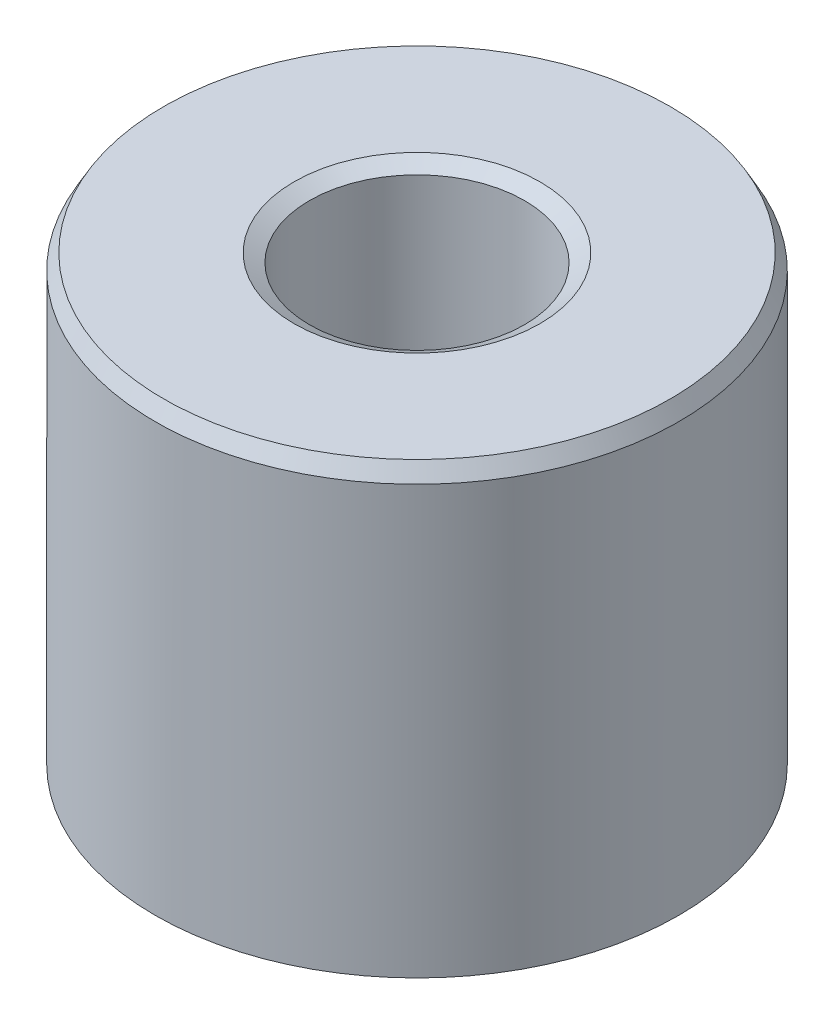
ISO-10303-21;
HEADER;
FILE_DESCRIPTION(('STEP AP214'),'2;1');
FILE_NAME('part.step','',(''),(''),'','','');
FILE_SCHEMA(('AUTOMOTIVE_DESIGN { 1 0 10303 214 1 1 1 1 }'));
ENDSEC;
DATA;
#1=APPLICATION_CONTEXT('core data for automotive mechanical design processes');
#2=APPLICATION_PROTOCOL_DEFINITION('international standard','automotive_design',2000,#1);
#3=PRODUCT_CONTEXT('',#1,'mechanical');
#4=PRODUCT('Part','Part','',(#3));
#5=PRODUCT_RELATED_PRODUCT_CATEGORY('part','',(#4));
#6=PRODUCT_DEFINITION_FORMATION('','',#4);
#7=PRODUCT_DEFINITION_CONTEXT('part definition',#1,'design');
#8=PRODUCT_DEFINITION('design','',#6,#7);
#9=PRODUCT_DEFINITION_SHAPE('','',#8);
#10=(LENGTH_UNIT() NAMED_UNIT(*) SI_UNIT(.MILLI.,.METRE.));
#11=(NAMED_UNIT(*) PLANE_ANGLE_UNIT() SI_UNIT($,.RADIAN.));
#12=(NAMED_UNIT(*) SI_UNIT($,.STERADIAN.) SOLID_ANGLE_UNIT());
#13=UNCERTAINTY_MEASURE_WITH_UNIT(LENGTH_MEASURE(1.E-05),#10,'distance_accuracy_value','');
#14=(GEOMETRIC_REPRESENTATION_CONTEXT(3) GLOBAL_UNCERTAINTY_ASSIGNED_CONTEXT((#13)) GLOBAL_UNIT_ASSIGNED_CONTEXT((#10,
#11,#12)) REPRESENTATION_CONTEXT('',''));
#15=CARTESIAN_POINT('',(0.,0.,0.));
#16=DIRECTION('',(0.,0.,1.));
#17=DIRECTION('',(1.,0.,0.));
#18=AXIS2_PLACEMENT_3D('',#15,#16,#17);
#19=CARTESIAN_POINT('',(0.,12.9313803341027,0.));
#20=DIRECTION('',(0.,-1.,0.));
#21=DIRECTION('',(0.,0.,-1.));
#22=AXIS2_PLACEMENT_3D('',#19,#20,#21);
#23=CYLINDRICAL_SURFACE('',#22,7.5);
#24=CARTESIAN_POINT('',(0.,0.245773306518281,0.));
#25=DIRECTION('',(0.,1.,0.));
#26=DIRECTION('',(0.,0.,1.));
#27=AXIS2_PLACEMENT_3D('',#24,#25,#26);
#28=CIRCLE('',#27,7.5);
#29=CARTESIAN_POINT('',(0.,0.245773306518279,-7.5));
#30=VERTEX_POINT('',#29);
#31=EDGE_CURVE('E10',#30,#30,#28,.T.);
#32=CARTESIAN_POINT('',(0.,12.4912057877324,0.));
#33=DIRECTION('',(0.,1.,0.));
#34=DIRECTION('',(0.,0.,1.));
#35=AXIS2_PLACEMENT_3D('',#32,#33,#34);
#36=CIRCLE('',#35,7.5);
#37=CARTESIAN_POINT('',(0.,12.4912057877324,-7.5));
#38=VERTEX_POINT('',#37);
#39=EDGE_CURVE('E50',#38,#38,#36,.F.);
#40=CARTESIAN_POINT('',(0.,0.245773306518279,-7.5));
#41=CARTESIAN_POINT('',(0.,0.373329894864259,-7.5));
#42=CARTESIAN_POINT('',(0.,0.50088648321024,-7.5));
#43=CARTESIAN_POINT('',(0.,0.755999659902201,-7.5));
#44=CARTESIAN_POINT('',(0.,0.883556248248181,-7.5));
#45=CARTESIAN_POINT('',(0.,1.13866942494014,-7.5));
#46=CARTESIAN_POINT('',(0.,1.26622601328612,-7.5));
#47=CARTESIAN_POINT('',(0.,1.52133918997808,-7.5));
#48=CARTESIAN_POINT('',(0.,1.64889577832406,-7.5));
#49=CARTESIAN_POINT('',(0.,1.90400895501603,-7.5));
#50=CARTESIAN_POINT('',(0.,2.03156554336201,-7.5));
#51=CARTESIAN_POINT('',(0.,2.28667872005397,-7.5));
#52=CARTESIAN_POINT('',(0.,2.41423530839995,-7.5));
#53=CARTESIAN_POINT('',(0.,2.66934848509191,-7.5));
#54=CARTESIAN_POINT('',(0.,2.79690507343789,-7.5));
#55=CARTESIAN_POINT('',(0.,3.05201825012985,-7.5));
#56=CARTESIAN_POINT('',(0.,3.17957483847583,-7.5));
#57=CARTESIAN_POINT('',(0.,3.43468801516779,-7.5));
#58=CARTESIAN_POINT('',(0.,3.56224460351377,-7.5));
#59=CARTESIAN_POINT('',(0.,3.81735778020573,-7.5));
#60=CARTESIAN_POINT('',(0.,3.94491436855171,-7.5));
#61=CARTESIAN_POINT('',(0.,4.20002754524368,-7.5));
#62=CARTESIAN_POINT('',(0.,4.32758413358966,-7.5));
#63=CARTESIAN_POINT('',(0.,4.58269731028162,-7.5));
#64=CARTESIAN_POINT('',(0.,4.7102538986276,-7.5));
#65=CARTESIAN_POINT('',(0.,4.96536707531956,-7.5));
#66=CARTESIAN_POINT('',(0.,5.09292366366554,-7.5));
#67=CARTESIAN_POINT('',(0.,5.3480368403575,-7.5));
#68=CARTESIAN_POINT('',(0.,5.47559342870348,-7.5));
#69=CARTESIAN_POINT('',(0.,5.73070660539544,-7.5));
#70=CARTESIAN_POINT('',(0.,5.85826319374142,-7.5));
#71=CARTESIAN_POINT('',(0.,6.11337637043338,-7.5));
#72=CARTESIAN_POINT('',(0.,6.24093295877936,-7.5));
#73=CARTESIAN_POINT('',(0.,6.49604613547132,-7.5));
#74=CARTESIAN_POINT('',(0.,6.6236027238173,-7.5));
#75=CARTESIAN_POINT('',(0.,6.87871590050927,-7.5));
#76=CARTESIAN_POINT('',(0.,7.00627248885525,-7.5));
#77=CARTESIAN_POINT('',(0.,7.26138566554721,-7.5));
#78=CARTESIAN_POINT('',(0.,7.38894225389319,-7.5));
#79=CARTESIAN_POINT('',(0.,7.64405543058515,-7.5));
#80=CARTESIAN_POINT('',(0.,7.77161201893113,-7.5));
#81=CARTESIAN_POINT('',(0.,8.02672519562309,-7.5));
#82=CARTESIAN_POINT('',(0.,8.15428178396907,-7.5));
#83=CARTESIAN_POINT('',(0.,8.40939496066103,-7.5));
#84=CARTESIAN_POINT('',(0.,8.53695154900701,-7.5));
#85=CARTESIAN_POINT('',(0.,8.79206472569897,-7.5));
#86=CARTESIAN_POINT('',(0.,8.91962131404495,-7.5));
#87=CARTESIAN_POINT('',(0.,9.17473449073691,-7.5));
#88=CARTESIAN_POINT('',(0.,9.30229107908289,-7.5));
#89=CARTESIAN_POINT('',(0.,9.55740425577486,-7.5));
#90=CARTESIAN_POINT('',(0.,9.68496084412084,-7.5));
#91=CARTESIAN_POINT('',(0.,9.9400740208128,-7.5));
#92=CARTESIAN_POINT('',(0.,10.0676306091588,-7.5));
#93=CARTESIAN_POINT('',(0.,10.3227437858507,-7.5));
#94=CARTESIAN_POINT('',(0.,10.4503003741967,-7.5));
#95=CARTESIAN_POINT('',(0.,10.7054135508887,-7.5));
#96=CARTESIAN_POINT('',(0.,10.8329701392347,-7.5));
#97=CARTESIAN_POINT('',(0.,11.0880833159266,-7.5));
#98=CARTESIAN_POINT('',(0.,11.2156399042726,-7.5));
#99=CARTESIAN_POINT('',(0.,11.4707530809646,-7.5));
#100=CARTESIAN_POINT('',(0.,11.5983096693105,-7.5));
#101=CARTESIAN_POINT('',(0.,11.8534228460025,-7.5));
#102=CARTESIAN_POINT('',(0.,11.9809794343485,-7.5));
#103=CARTESIAN_POINT('',(0.,12.2360926110404,-7.5));
#104=CARTESIAN_POINT('',(0.,12.3636491993864,-7.5));
#105=CARTESIAN_POINT('',(0.,12.4912057877324,-7.5));
#106=B_SPLINE_CURVE_WITH_KNOTS('',3,(#40,#41,#42,#43,#44,#45,#46,#47,#48,#49,#50,#51,#52,#53,
#54,#55,#56,#57,#58,#59,#60,#61,#62,#63,#64,#65,#66,#67,#68,#69,#70,#71,#72,#73,#74,#75,#76,#77,
#78,#79,#80,#81,#82,#83,#84,#85,#86,#87,#88,#89,#90,#91,#92,#93,#94,#95,#96,#97,#98,#99,#100,
#101,#102,#103,#104,#105),.UNSPECIFIED.,.F.,.F.,(4,2,2,2,2,2,2,2,2,2,2,2,2,2,2,2,2,2,2,2,2,2,2,
2,2,2,2,2,2,2,2,2,4),(0.,0.382669765037941,0.765339530075883,1.14800929511382,1.53067906015177,
1.91334882518971,2.29601859022765,2.67868835526559,3.06135812030353,3.44402788534147,
3.82669765037942,4.20936741541736,4.5920371804553,4.97470694549324,5.35737671053118,
5.74004647556912,6.12271624060706,6.50538600564501,6.88805577068295,7.27072553572089,
7.65339530075883,8.03606506579677,8.41873483083471,8.80140459587265,9.18407436091059,
9.56674412594854,9.94941389098648,10.3320836560244,10.7147534210624,11.0974231861003,
11.4800929511382,11.8627627161762,12.2454324812141),.UNSPECIFIED.);
#107=EDGE_CURVE('BSEAM39',#30,#38,#106,.T.);
#108=ORIENTED_EDGE('',*,*,#31,.T.);
#109=ORIENTED_EDGE('',*,*,#39,.T.);
#110=ORIENTED_EDGE('',*,*,#107,.T.);
#111=ORIENTED_EDGE('',*,*,#107,.F.);
#112=EDGE_LOOP('',(#108,#110,#109,#111));
#113=FACE_BOUND('',#112,.T.);
#114=ADVANCED_FACE('F39',(#113),#23,.T.);
#115=CARTESIAN_POINT('',(0.,12.9313803341027,0.));
#116=DIRECTION('',(0.,1.,0.));
#117=DIRECTION('',(0.,0.,1.));
#118=AXIS2_PLACEMENT_3D('',#115,#116,#117);
#119=PLANE('',#118);
#120=CARTESIAN_POINT('',(0.,12.9313803341027,0.));
#121=DIRECTION('',(0.,1.,0.));
#122=DIRECTION('',(0.,0.,1.));
#123=AXIS2_PLACEMENT_3D('',#120,#121,#122);
#124=CIRCLE('',#123,3.52107057516829);
#125=CARTESIAN_POINT('',(0.,12.9313803341027,3.52107057516829));
#126=VERTEX_POINT('',#125);
#127=EDGE_CURVE('E58',#126,#126,#124,.F.);
#128=ORIENTED_EDGE('',*,*,#127,.T.);
#129=EDGE_LOOP('',(#128));
#130=FACE_BOUND('',#129,.T.);
#131=CARTESIAN_POINT('',(0.,12.9313803341027,0.));
#132=DIRECTION('',(0.,1.,0.));
#133=DIRECTION('',(0.,0.,1.));
#134=AXIS2_PLACEMENT_3D('',#131,#132,#133);
#135=CIRCLE('',#134,7.25422669348173);
#136=CARTESIAN_POINT('',(0.,12.9313803341027,-7.25422669348173));
#137=VERTEX_POINT('',#136);
#138=EDGE_CURVE('E61',#137,#137,#135,.T.);
#139=ORIENTED_EDGE('',*,*,#138,.T.);
#140=EDGE_LOOP('',(#139));
#141=FACE_BOUND('',#140,.T.);
#142=ADVANCED_FACE('F88',(#130,#141),#119,.T.);
#143=CARTESIAN_POINT('',(0.,0.,0.));
#144=DIRECTION('',(0.,1.,0.));
#145=DIRECTION('',(0.,0.,1.));
#146=AXIS2_PLACEMENT_3D('',#143,#144,#145);
#147=PLANE('',#146);
#148=CARTESIAN_POINT('',(0.,0.,0.));
#149=DIRECTION('',(0.,1.,0.));
#150=DIRECTION('',(0.,0.,1.));
#151=AXIS2_PLACEMENT_3D('',#148,#149,#150);
#152=CIRCLE('',#151,3.32666933531626);
#153=CARTESIAN_POINT('',(0.,0.,3.32666933531626));
#154=VERTEX_POINT('',#153);
#155=EDGE_CURVE('E51',#154,#154,#152,.T.);
#156=ORIENTED_EDGE('',*,*,#155,.T.);
#157=EDGE_LOOP('',(#156));
#158=FACE_BOUND('',#157,.T.);
#159=CARTESIAN_POINT('',(0.,0.,0.));
#160=DIRECTION('',(0.,1.,0.));
#161=DIRECTION('',(0.,0.,1.));
#162=AXIS2_PLACEMENT_3D('',#159,#160,#161);
#163=CIRCLE('',#162,7.05982545362971);
#164=CARTESIAN_POINT('',(0.,0.,7.05982545362971));
#165=VERTEX_POINT('',#164);
#166=EDGE_CURVE('E54',#165,#165,#163,.F.);
#167=ORIENTED_EDGE('',*,*,#166,.T.);
#168=EDGE_LOOP('',(#167));
#169=FACE_BOUND('',#168,.T.);
#170=ADVANCED_FACE('F83',(#158,#169),#147,.F.);
#171=CARTESIAN_POINT('',(0.,12.9313803341027,0.));
#172=DIRECTION('',(0.,-1.,0.));
#173=DIRECTION('',(0.,0.,-1.));
#174=AXIS2_PLACEMENT_3D('',#171,#172,#173);
#175=CYLINDRICAL_SURFACE('',#174,3.080896028798);
#176=CARTESIAN_POINT('',(0.,12.6856070275844,0.));
#177=DIRECTION('',(0.,1.,0.));
#178=DIRECTION('',(0.,0.,1.));
#179=AXIS2_PLACEMENT_3D('',#176,#177,#178);
#180=CIRCLE('',#179,3.080896028798);
#181=CARTESIAN_POINT('',(0.,12.6856070275844,-3.080896028798));
#182=VERTEX_POINT('',#181);
#183=EDGE_CURVE('E67',#182,#182,#180,.T.);
#184=CARTESIAN_POINT('',(0.,0.440174546370261,0.));
#185=DIRECTION('',(0.,1.,0.));
#186=DIRECTION('',(0.,0.,1.));
#187=AXIS2_PLACEMENT_3D('',#184,#185,#186);
#188=CIRCLE('',#187,3.080896028798);
#189=CARTESIAN_POINT('',(0.,0.440174546370261,-3.080896028798));
#190=VERTEX_POINT('',#189);
#191=EDGE_CURVE('E69',#190,#190,#188,.F.);
#192=CARTESIAN_POINT('',(0.,12.6856070275844,-3.080896028798));
#193=CARTESIAN_POINT('',(0.,12.5580504392384,-3.080896028798));
#194=CARTESIAN_POINT('',(0.,12.4304938508924,-3.080896028798));
#195=CARTESIAN_POINT('',(0.,12.1753806742005,-3.080896028798));
#196=CARTESIAN_POINT('',(0.,12.0478240858545,-3.080896028798));
#197=CARTESIAN_POINT('',(0.,11.7927109091625,-3.080896028798));
#198=CARTESIAN_POINT('',(0.,11.6651543208166,-3.080896028798));
#199=CARTESIAN_POINT('',(0.,11.4100411441246,-3.080896028798));
#200=CARTESIAN_POINT('',(0.,11.2824845557786,-3.080896028798));
#201=CARTESIAN_POINT('',(0.,11.0273713790867,-3.080896028798));
#202=CARTESIAN_POINT('',(0.,10.8998147907407,-3.080896028798));
#203=CARTESIAN_POINT('',(0.,10.6447016140487,-3.080896028798));
#204=CARTESIAN_POINT('',(0.,10.5171450257027,-3.080896028798));
#205=CARTESIAN_POINT('',(0.,10.2620318490108,-3.080896028798));
#206=CARTESIAN_POINT('',(0.,10.1344752606648,-3.080896028798));
#207=CARTESIAN_POINT('',(0.,9.87936208397283,-3.080896028798));
#208=CARTESIAN_POINT('',(0.,9.75180549562685,-3.080896028798));
#209=CARTESIAN_POINT('',(0.,9.49669231893489,-3.080896028798));
#210=CARTESIAN_POINT('',(0.,9.3691357305889,-3.080896028798));
#211=CARTESIAN_POINT('',(0.,9.11402255389694,-3.080896028798));
#212=CARTESIAN_POINT('',(0.,8.98646596555096,-3.080896028798));
#213=CARTESIAN_POINT('',(0.,8.731352788859,-3.080896028798));
#214=CARTESIAN_POINT('',(0.,8.60379620051302,-3.080896028798));
#215=CARTESIAN_POINT('',(0.,8.34868302382106,-3.080896028798));
#216=CARTESIAN_POINT('',(0.,8.22112643547508,-3.080896028798));
#217=CARTESIAN_POINT('',(0.,7.96601325878312,-3.080896028798));
#218=CARTESIAN_POINT('',(0.,7.83845667043714,-3.080896028798));
#219=CARTESIAN_POINT('',(0.,7.58334349374518,-3.080896028798));
#220=CARTESIAN_POINT('',(0.,7.4557869053992,-3.080896028798));
#221=CARTESIAN_POINT('',(0.,7.20067372870723,-3.080896028798));
#222=CARTESIAN_POINT('',(0.,7.07311714036125,-3.080896028798));
#223=CARTESIAN_POINT('',(0.,6.81800396366929,-3.080896028798));
#224=CARTESIAN_POINT('',(0.,6.69044737532331,-3.080896028798));
#225=CARTESIAN_POINT('',(0.,6.43533419863135,-3.080896028798));
#226=CARTESIAN_POINT('',(0.,6.30777761028537,-3.080896028798));
#227=CARTESIAN_POINT('',(0.,6.05266443359341,-3.080896028798));
#228=CARTESIAN_POINT('',(0.,5.92510784524743,-3.080896028798));
#229=CARTESIAN_POINT('',(0.,5.66999466855547,-3.080896028798));
#230=CARTESIAN_POINT('',(0.,5.54243808020949,-3.080896028798));
#231=CARTESIAN_POINT('',(0.,5.28732490351752,-3.080896028798));
#232=CARTESIAN_POINT('',(0.,5.15976831517155,-3.080896028798));
#233=CARTESIAN_POINT('',(0.,4.90465513847958,-3.080896028798));
#234=CARTESIAN_POINT('',(0.,4.7770985501336,-3.080896028798));
#235=CARTESIAN_POINT('',(0.,4.52198537344164,-3.080896028798));
#236=CARTESIAN_POINT('',(0.,4.39442878509566,-3.080896028798));
#237=CARTESIAN_POINT('',(0.,4.1393156084037,-3.080896028798));
#238=CARTESIAN_POINT('',(0.,4.01175902005772,-3.080896028798));
#239=CARTESIAN_POINT('',(0.,3.75664584336576,-3.080896028798));
#240=CARTESIAN_POINT('',(0.,3.62908925501978,-3.080896028798));
#241=CARTESIAN_POINT('',(0.,3.37397607832782,-3.080896028798));
#242=CARTESIAN_POINT('',(0.,3.24641948998184,-3.080896028798));
#243=CARTESIAN_POINT('',(0.,2.99130631328987,-3.080896028798));
#244=CARTESIAN_POINT('',(0.,2.86374972494389,-3.080896028798));
#245=CARTESIAN_POINT('',(0.,2.60863654825193,-3.080896028798));
#246=CARTESIAN_POINT('',(0.,2.48107995990595,-3.080896028798));
#247=CARTESIAN_POINT('',(0.,2.22596678321399,-3.080896028798));
#248=CARTESIAN_POINT('',(0.,2.09841019486801,-3.080896028798));
#249=CARTESIAN_POINT('',(0.,1.84329701817605,-3.080896028798));
#250=CARTESIAN_POINT('',(0.,1.71574042983007,-3.080896028798));
#251=CARTESIAN_POINT('',(0.,1.46062725313811,-3.080896028798));
#252=CARTESIAN_POINT('',(0.,1.33307066479213,-3.080896028798));
#253=CARTESIAN_POINT('',(0.,1.07795748810016,-3.080896028798));
#254=CARTESIAN_POINT('',(0.,0.950400899754184,-3.080896028798));
#255=CARTESIAN_POINT('',(0.,0.695287723062222,-3.080896028798));
#256=CARTESIAN_POINT('',(0.,0.567731134716242,-3.080896028798));
#257=CARTESIAN_POINT('',(0.,0.440174546370261,-3.080896028798));
#258=B_SPLINE_CURVE_WITH_KNOTS('',3,(#192,#193,#194,#195,#196,#197,#198,#199,#200,#201,#202,
#203,#204,#205,#206,#207,#208,#209,#210,#211,#212,#213,#214,#215,#216,#217,#218,#219,#220,#221,
#222,#223,#224,#225,#226,#227,#228,#229,#230,#231,#232,#233,#234,#235,#236,#237,#238,#239,#240,
#241,#242,#243,#244,#245,#246,#247,#248,#249,#250,#251,#252,#253,#254,#255,#256,#257),
.UNSPECIFIED.,.F.,.F.,(4,2,2,2,2,2,2,2,2,2,2,2,2,2,2,2,2,2,2,2,2,2,2,2,2,2,2,2,2,2,2,2,4),(0.,
0.382669765037941,0.765339530075883,1.14800929511382,1.53067906015177,1.91334882518971,
2.29601859022765,2.67868835526559,3.06135812030353,3.44402788534148,3.82669765037942,
4.20936741541736,4.5920371804553,4.97470694549324,5.35737671053118,5.74004647556913,
6.12271624060707,6.50538600564501,6.88805577068295,7.27072553572089,7.65339530075883,
8.03606506579678,8.41873483083472,8.80140459587266,9.1840743609106,9.56674412594855,
9.94941389098649,10.3320836560244,10.7147534210624,11.0974231861003,11.4800929511383,
11.8627627161762,12.2454324812141),.UNSPECIFIED.);
#259=EDGE_CURVE('BSEAM71',#182,#190,#258,.T.);
#260=ORIENTED_EDGE('',*,*,#183,.T.);
#261=ORIENTED_EDGE('',*,*,#191,.T.);
#262=ORIENTED_EDGE('',*,*,#259,.T.);
#263=ORIENTED_EDGE('',*,*,#259,.F.);
#264=EDGE_LOOP('',(#260,#262,#261,#263));
#265=FACE_BOUND('',#264,.T.);
#266=ADVANCED_FACE('F71',(#265),#175,.F.);
#267=CARTESIAN_POINT('',(0.,12.6856070275844,0.));
#268=DIRECTION('',(0.,1.,0.));
#269=DIRECTION('',(0.,0.,1.));
#270=AXIS2_PLACEMENT_3D('',#267,#268,#269);
#271=CONICAL_SURFACE('',#270,3.080896028798,1.06156177701953);
#272=ORIENTED_EDGE('',*,*,#127,.F.);
#273=EDGE_LOOP('',(#272));
#274=FACE_BOUND('',#273,.T.);
#275=ORIENTED_EDGE('',*,*,#183,.F.);
#276=EDGE_LOOP('',(#275));
#277=FACE_BOUND('',#276,.T.);
#278=ADVANCED_FACE('F77',(#274,#277),#271,.F.);
#279=CARTESIAN_POINT('',(0.,0.,0.));
#280=DIRECTION('',(0.,-1.,0.));
#281=DIRECTION('',(0.,0.,-1.));
#282=AXIS2_PLACEMENT_3D('',#279,#280,#281);
#283=CONICAL_SURFACE('',#282,3.32666933531626,0.509234549775371);
#284=ORIENTED_EDGE('',*,*,#191,.F.);
#285=EDGE_LOOP('',(#284));
#286=FACE_BOUND('',#285,.T.);
#287=ORIENTED_EDGE('',*,*,#155,.F.);
#288=EDGE_LOOP('',(#287));
#289=FACE_BOUND('',#288,.T.);
#290=ADVANCED_FACE('F73',(#286,#289),#283,.F.);
#291=CARTESIAN_POINT('',(0.,0.245773306518281,0.));
#292=DIRECTION('',(0.,1.,0.));
#293=DIRECTION('',(0.,0.,1.));
#294=AXIS2_PLACEMENT_3D('',#291,#292,#293);
#295=CONICAL_SURFACE('',#294,7.5,1.06156177701952);
#296=ORIENTED_EDGE('',*,*,#166,.F.);
#297=EDGE_LOOP('',(#296));
#298=FACE_BOUND('',#297,.T.);
#299=ORIENTED_EDGE('',*,*,#31,.F.);
#300=EDGE_LOOP('',(#299));
#301=FACE_BOUND('',#300,.T.);
#302=ADVANCED_FACE('F76',(#298,#301),#295,.T.);
#303=CARTESIAN_POINT('',(0.,12.9313803341027,0.));
#304=DIRECTION('',(0.,-1.,0.));
#305=DIRECTION('',(0.,0.,-1.));
#306=AXIS2_PLACEMENT_3D('',#303,#304,#305);
#307=CONICAL_SURFACE('',#306,7.25422669348173,0.509234549775373);
#308=CARTESIAN_POINT('',(0.,12.4912057877324,-7.5));
#309=CARTESIAN_POINT('',(0.,12.4957909392571,-7.49743986139043));
#310=CARTESIAN_POINT('',(0.,12.5003760907818,-7.49487972278087));
#311=CARTESIAN_POINT('',(0.,12.5095463938312,-7.48975944556174));
#312=CARTESIAN_POINT('',(0.,12.5141315453559,-7.48719930695217));
#313=CARTESIAN_POINT('',(0.,12.5233018484052,-7.48207902973304));
#314=CARTESIAN_POINT('',(0.,12.5278869999299,-7.47951889112348));
#315=CARTESIAN_POINT('',(0.,12.5370573029793,-7.47439861390435));
#316=CARTESIAN_POINT('',(0.,12.541642454504,-7.47183847529478));
#317=CARTESIAN_POINT('',(0.,12.5508127575534,-7.46671819807565));
#318=CARTESIAN_POINT('',(0.,12.5553979090781,-7.46415805946609));
#319=CARTESIAN_POINT('',(0.,12.5645682121275,-7.45903778224696));
#320=CARTESIAN_POINT('',(0.,12.5691533636521,-7.45647764363739));
#321=CARTESIAN_POINT('',(0.,12.5783236667015,-7.45135736641826));
#322=CARTESIAN_POINT('',(0.,12.5829088182262,-7.44879722780869));
#323=CARTESIAN_POINT('',(0.,12.5920791212756,-7.44367695058956));
#324=CARTESIAN_POINT('',(0.,12.5966642728003,-7.44111681198));
#325=CARTESIAN_POINT('',(0.,12.6058345758497,-7.43599653476087));
#326=CARTESIAN_POINT('',(0.,12.6104197273744,-7.4334363961513));
#327=CARTESIAN_POINT('',(0.,12.6195900304237,-7.42831611893217));
#328=CARTESIAN_POINT('',(0.,12.6241751819484,-7.42575598032261));
#329=CARTESIAN_POINT('',(0.,12.6333454849978,-7.42063570310348));
#330=CARTESIAN_POINT('',(0.,12.6379306365225,-7.41807556449391));
#331=CARTESIAN_POINT('',(0.,12.6471009395719,-7.41295528727478));
#332=CARTESIAN_POINT('',(0.,12.6516860910966,-7.41039514866521));
#333=CARTESIAN_POINT('',(0.,12.660856394146,-7.40527487144608));
#334=CARTESIAN_POINT('',(0.,12.6654415456706,-7.40271473283652));
#335=CARTESIAN_POINT('',(0.,12.67461184872,-7.39759445561739));
#336=CARTESIAN_POINT('',(0.,12.6791970002447,-7.39503431700782));
#337=CARTESIAN_POINT('',(0.,12.6883673032941,-7.38991403978869));
#338=CARTESIAN_POINT('',(0.,12.6929524548188,-7.38735390117913));
#339=CARTESIAN_POINT('',(0.,12.7021227578682,-7.38223362396));
#340=CARTESIAN_POINT('',(0.,12.7067079093929,-7.37967348535043));
#341=CARTESIAN_POINT('',(0.,12.7158782124422,-7.3745532081313));
#342=CARTESIAN_POINT('',(0.,12.7204633639669,-7.37199306952173));
#343=CARTESIAN_POINT('',(0.,12.7296336670163,-7.3668727923026));
#344=CARTESIAN_POINT('',(0.,12.734218818541,-7.36431265369304));
#345=CARTESIAN_POINT('',(0.,12.7433891215904,-7.35919237647391));
#346=CARTESIAN_POINT('',(0.,12.7479742731151,-7.35663223786434));
#347=CARTESIAN_POINT('',(0.,12.7571445761644,-7.35151196064521));
#348=CARTESIAN_POINT('',(0.,12.7617297276891,-7.34895182203565));
#349=CARTESIAN_POINT('',(0.,12.7709000307385,-7.34383154481652));
#350=CARTESIAN_POINT('',(0.,12.7754851822632,-7.34127140620695));
#351=CARTESIAN_POINT('',(0.,12.7846554853126,-7.33615112898782));
#352=CARTESIAN_POINT('',(0.,12.7892406368373,-7.33359099037825));
#353=CARTESIAN_POINT('',(0.,12.7984109398867,-7.32847071315912));
#354=CARTESIAN_POINT('',(0.,12.8029960914114,-7.32591057454956));
#355=CARTESIAN_POINT('',(0.,12.8121663944607,-7.32079029733043));
#356=CARTESIAN_POINT('',(0.,12.8167515459854,-7.31823015872086));
#357=CARTESIAN_POINT('',(0.,12.8259218490348,-7.31310988150173));
#358=CARTESIAN_POINT('',(0.,12.8305070005595,-7.31054974289217));
#359=CARTESIAN_POINT('',(0.,12.8396773036089,-7.30542946567304));
#360=CARTESIAN_POINT('',(0.,12.8442624551336,-7.30286932706347));
#361=CARTESIAN_POINT('',(0.,12.8534327581829,-7.29774904984434));
#362=CARTESIAN_POINT('',(0.,12.8580179097076,-7.29518891123477));
#363=CARTESIAN_POINT('',(0.,12.867188212757,-7.29006863401564));
#364=CARTESIAN_POINT('',(0.,12.8717733642817,-7.28750849540608));
#365=CARTESIAN_POINT('',(0.,12.8809436673311,-7.28238821818695));
#366=CARTESIAN_POINT('',(0.,12.8855288188558,-7.27982807957738));
#367=CARTESIAN_POINT('',(0.,12.8946991219052,-7.27470780235825));
#368=CARTESIAN_POINT('',(0.,12.8992842734298,-7.27214766374869));
#369=CARTESIAN_POINT('',(0.,12.9084545764792,-7.26702738652956));
#370=CARTESIAN_POINT('',(0.,12.9130397280039,-7.26446724791999));
#371=CARTESIAN_POINT('',(0.,12.9222100310533,-7.25934697070086));
#372=CARTESIAN_POINT('',(0.,12.926795182578,-7.25678683209129));
#373=CARTESIAN_POINT('',(0.,12.9313803341027,-7.25422669348173));
#374=B_SPLINE_CURVE_WITH_KNOTS('',3,(#308,#309,#310,#311,#312,#313,#314,#315,#316,#317,#318,
#319,#320,#321,#322,#323,#324,#325,#326,#327,#328,#329,#330,#331,#332,#333,#334,#335,#336,#337,
#338,#339,#340,#341,#342,#343,#344,#345,#346,#347,#348,#349,#350,#351,#352,#353,#354,#355,#356,
#357,#358,#359,#360,#361,#362,#363,#364,#365,#366,#367,#368,#369,#370,#371,#372,#373),
.UNSPECIFIED.,.F.,.F.,(4,2,2,2,2,2,2,2,2,2,2,2,2,2,2,2,2,2,2,2,2,2,2,2,2,2,2,2,2,2,2,2,4),(0.,
0.0157544062992245,0.0315088125984486,0.0472632188976716,0.0630176251968956,0.0787720314961182,
0.0945264377953427,0.110280844094565,0.12603525039379,0.141789656693014,0.157544062992236,
0.173298469291461,0.189052875590683,0.204807281889908,0.22056168818913,0.236316094488355,
0.252070500787578,0.267824907086802,0.283579313386026,0.299333719685249,0.315088125984473,
0.330842532283696,0.34659693858292,0.362351344882143,0.378105751181367,0.393860157480591,
0.409614563779814,0.425368970079038,0.441123376378261,0.456877782677485,0.472632188976708,
0.488386595275932,0.504141001575156),.UNSPECIFIED.);
#375=EDGE_CURVE('BSEAM45',#38,#137,#374,.T.);
#376=ORIENTED_EDGE('',*,*,#39,.F.);
#377=ORIENTED_EDGE('',*,*,#138,.F.);
#378=ORIENTED_EDGE('',*,*,#375,.T.);
#379=ORIENTED_EDGE('',*,*,#375,.F.);
#380=EDGE_LOOP('',(#376,#378,#377,#379));
#381=FACE_BOUND('',#380,.T.);
#382=ADVANCED_FACE('F45',(#381),#307,.T.);
#383=CLOSED_SHELL('',(#114,#142,#170,#266,#278,#290,#302,#382));
#384=MANIFOLD_SOLID_BREP('B2',#383);
#385=ADVANCED_BREP_SHAPE_REPRESENTATION('',(#18,#384),#14);
#386=SHAPE_DEFINITION_REPRESENTATION(#9,#385);
ENDSEC;
END-ISO-10303-21;
